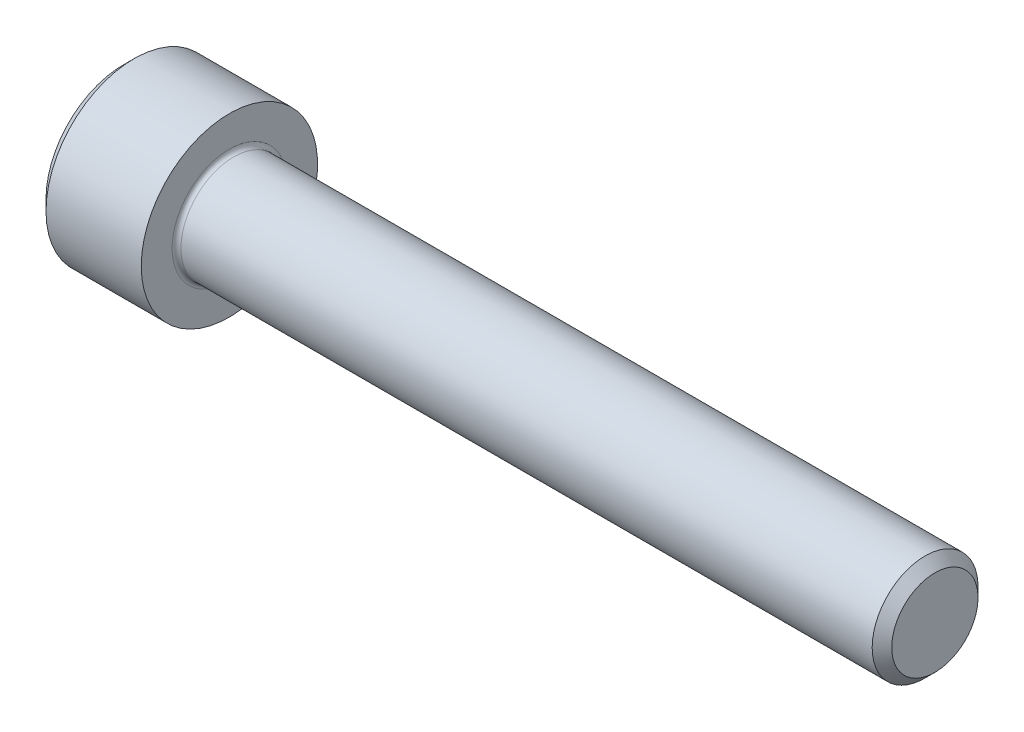
ISO-10303-21;
HEADER;
FILE_DESCRIPTION(('STEP AP214'),'2;1');
FILE_NAME('part.step','',(''),(''),'','','');
FILE_SCHEMA(('AUTOMOTIVE_DESIGN { 1 0 10303 214 1 1 1 1 }'));
ENDSEC;
DATA;
#1=APPLICATION_CONTEXT('core data for automotive mechanical design processes');
#2=APPLICATION_PROTOCOL_DEFINITION('international standard','automotive_design',2000,#1);
#3=PRODUCT_CONTEXT('',#1,'mechanical');
#4=PRODUCT('Part','Part','',(#3));
#5=PRODUCT_RELATED_PRODUCT_CATEGORY('part','',(#4));
#6=PRODUCT_DEFINITION_FORMATION('','',#4);
#7=PRODUCT_DEFINITION_CONTEXT('part definition',#1,'design');
#8=PRODUCT_DEFINITION('design','',#6,#7);
#9=PRODUCT_DEFINITION_SHAPE('','',#8);
#10=(LENGTH_UNIT() NAMED_UNIT(*) SI_UNIT(.MILLI.,.METRE.));
#11=(NAMED_UNIT(*) PLANE_ANGLE_UNIT() SI_UNIT($,.RADIAN.));
#12=(NAMED_UNIT(*) SI_UNIT($,.STERADIAN.) SOLID_ANGLE_UNIT());
#13=UNCERTAINTY_MEASURE_WITH_UNIT(LENGTH_MEASURE(1.E-05),#10,'distance_accuracy_value','');
#14=(GEOMETRIC_REPRESENTATION_CONTEXT(3) GLOBAL_UNCERTAINTY_ASSIGNED_CONTEXT((#13)) GLOBAL_UNIT_ASSIGNED_CONTEXT((#10,
#11,#12)) REPRESENTATION_CONTEXT('',''));
#15=CARTESIAN_POINT('',(0.,0.,0.));
#16=DIRECTION('',(0.,0.,1.));
#17=DIRECTION('',(1.,0.,0.));
#18=AXIS2_PLACEMENT_3D('',#15,#16,#17);
#19=CARTESIAN_POINT('',(0.,0.,0.));
#20=DIRECTION('',(-1.,0.,0.));
#21=DIRECTION('',(0.,0.,1.));
#22=AXIS2_PLACEMENT_3D('',#19,#20,#21);
#23=PLANE('',#22);
#24=DIRECTION('',(0.,-0.5,0.866025403784438));
#25=VECTOR('',#24,1.);
#26=CARTESIAN_POINT('',(0.,2.93524876856006,0.));
#27=LINE('',#26,#25);
#28=CARTESIAN_POINT('',(0.,2.93524876856006,0.));
#29=VERTEX_POINT('',#28);
#30=CARTESIAN_POINT('',(0.,1.46762438428003,2.542));
#31=VERTEX_POINT('',#30);
#32=EDGE_CURVE('E387',#29,#31,#27,.T.);
#33=ORIENTED_EDGE('',*,*,#32,.T.);
#34=DIRECTION('',(0.,1.,0.));
#35=VECTOR('',#34,1.);
#36=CARTESIAN_POINT('',(0.,-1.46762438428003,2.542));
#37=LINE('',#36,#35);
#38=CARTESIAN_POINT('',(0.,-1.46762438428003,2.542));
#39=VERTEX_POINT('',#38);
#40=EDGE_CURVE('E131',#39,#31,#37,.T.);
#41=ORIENTED_EDGE('',*,*,#40,.F.);
#42=DIRECTION('',(0.,-0.500000000000001,-0.866025403784438));
#43=VECTOR('',#42,1.);
#44=CARTESIAN_POINT('',(0.,-1.46762438428003,2.542));
#45=LINE('',#44,#43);
#46=CARTESIAN_POINT('',(0.,-2.93524876856006,0.));
#47=VERTEX_POINT('',#46);
#48=EDGE_CURVE('E390',#39,#47,#45,.T.);
#49=ORIENTED_EDGE('',*,*,#48,.T.);
#50=DIRECTION('',(0.,0.5,-0.866025403784439));
#51=VECTOR('',#50,1.);
#52=CARTESIAN_POINT('',(0.,-2.93524876856006,0.));
#53=LINE('',#52,#51);
#54=CARTESIAN_POINT('',(0.,-1.46762438428003,-2.542));
#55=VERTEX_POINT('',#54);
#56=EDGE_CURVE('E393',#47,#55,#53,.T.);
#57=ORIENTED_EDGE('',*,*,#56,.T.);
#58=DIRECTION('',(0.,-1.,0.));
#59=VECTOR('',#58,1.);
#60=CARTESIAN_POINT('',(0.,1.46762438428002,-2.542));
#61=LINE('',#60,#59);
#62=CARTESIAN_POINT('',(0.,1.46762438428002,-2.542));
#63=VERTEX_POINT('',#62);
#64=EDGE_CURVE('E396',#63,#55,#61,.T.);
#65=ORIENTED_EDGE('',*,*,#64,.F.);
#66=DIRECTION('',(0.,-0.500000000000001,-0.866025403784438));
#67=VECTOR('',#66,1.);
#68=CARTESIAN_POINT('',(0.,2.93524876856006,0.));
#69=LINE('',#68,#67);
#70=EDGE_CURVE('E126',#29,#63,#69,.T.);
#71=ORIENTED_EDGE('',*,*,#70,.F.);
#72=EDGE_LOOP('',(#33,#41,#49,#57,#65,#71));
#73=FACE_BOUND('',#72,.T.);
#74=CARTESIAN_POINT('',(0.,0.,0.));
#75=DIRECTION('',(-1.,0.,0.));
#76=DIRECTION('',(0.,0.,1.));
#77=AXIS2_PLACEMENT_3D('',#74,#75,#76);
#78=CIRCLE('',#77,4.4);
#79=CARTESIAN_POINT('',(0.,0.,4.4));
#80=VERTEX_POINT('',#79);
#81=EDGE_CURVE('E142',#80,#80,#78,.T.);
#82=ORIENTED_EDGE('',*,*,#81,.T.);
#83=EDGE_LOOP('',(#82));
#84=FACE_BOUND('',#83,.T.);
#85=ADVANCED_FACE('F35',(#73,#84),#23,.T.);
#86=CARTESIAN_POINT('',(46.,2.4455,0.));
#87=DIRECTION('',(1.,0.,0.));
#88=DIRECTION('',(0.,0.,-1.));
#89=AXIS2_PLACEMENT_3D('',#86,#87,#88);
#90=PLANE('',#89);
#91=CARTESIAN_POINT('',(46.,0.,0.));
#92=DIRECTION('',(-1.,0.,0.));
#93=DIRECTION('',(0.,0.,1.));
#94=AXIS2_PLACEMENT_3D('',#91,#92,#93);
#95=CIRCLE('',#94,2.4455);
#96=CARTESIAN_POINT('',(46.,0.,2.4455));
#97=VERTEX_POINT('',#96);
#98=EDGE_CURVE('E155',#97,#97,#95,.T.);
#99=ORIENTED_EDGE('',*,*,#98,.F.);
#100=EDGE_LOOP('',(#99));
#101=FACE_BOUND('',#100,.T.);
#102=ADVANCED_FACE('F176',(#101),#90,.T.);
#103=CARTESIAN_POINT('',(46.,0.,0.));
#104=DIRECTION('',(-1.,0.,0.));
#105=DIRECTION('',(0.,0.,1.));
#106=AXIS2_PLACEMENT_3D('',#103,#104,#105);
#107=CONICAL_SURFACE('',#106,2.4455,0.785398163397216);
#108=CARTESIAN_POINT('',(45.4454999999999,0.,0.));
#109=DIRECTION('',(-1.,0.,0.));
#110=DIRECTION('',(0.,0.,1.));
#111=AXIS2_PLACEMENT_3D('',#108,#109,#110);
#112=CIRCLE('',#111,2.99999999999987);
#113=CARTESIAN_POINT('',(45.4454999999999,0.,2.99999999999987));
#114=VERTEX_POINT('',#113);
#115=EDGE_CURVE('E152',#114,#114,#112,.T.);
#116=ORIENTED_EDGE('',*,*,#115,.F.);
#117=EDGE_LOOP('',(#116));
#118=FACE_BOUND('',#117,.T.);
#119=ORIENTED_EDGE('',*,*,#98,.T.);
#120=EDGE_LOOP('',(#119));
#121=FACE_BOUND('',#120,.T.);
#122=ADVANCED_FACE('F182',(#118,#121),#107,.T.);
#123=CARTESIAN_POINT('',(-31.75,0.,0.));
#124=DIRECTION('',(-1.,0.,0.));
#125=DIRECTION('',(0.,0.,1.));
#126=AXIS2_PLACEMENT_3D('',#123,#124,#125);
#127=CYLINDRICAL_SURFACE('',#126,2.99999999999993);
#128=CARTESIAN_POINT('',(6.25,0.,0.));
#129=DIRECTION('',(1.,0.,0.));
#130=DIRECTION('',(0.,0.,-1.));
#131=AXIS2_PLACEMENT_3D('',#128,#129,#130);
#132=CIRCLE('',#131,2.99999999999993);
#133=CARTESIAN_POINT('',(6.25,0.,-2.99999999999993));
#134=VERTEX_POINT('',#133);
#135=EDGE_CURVE('E11',#134,#134,#132,.T.);
#136=ORIENTED_EDGE('',*,*,#135,.T.);
#137=EDGE_LOOP('',(#136));
#138=FACE_BOUND('',#137,.T.);
#139=ORIENTED_EDGE('',*,*,#115,.T.);
#140=EDGE_LOOP('',(#139));
#141=FACE_BOUND('',#140,.T.);
#142=ADVANCED_FACE('F193',(#138,#141),#127,.T.);
#143=CARTESIAN_POINT('',(6.,5.,0.));
#144=DIRECTION('',(1.,0.,0.));
#145=DIRECTION('',(0.,0.,-1.));
#146=AXIS2_PLACEMENT_3D('',#143,#144,#145);
#147=PLANE('',#146);
#148=CARTESIAN_POINT('',(6.,0.,0.));
#149=DIRECTION('',(1.,0.,0.));
#150=DIRECTION('',(0.,0.,-1.));
#151=AXIS2_PLACEMENT_3D('',#148,#149,#150);
#152=CIRCLE('',#151,3.24999999999993);
#153=CARTESIAN_POINT('',(6.,0.,-3.24999999999993));
#154=VERTEX_POINT('',#153);
#155=EDGE_CURVE('E43',#154,#154,#152,.F.);
#156=ORIENTED_EDGE('',*,*,#155,.T.);
#157=EDGE_LOOP('',(#156));
#158=FACE_BOUND('',#157,.T.);
#159=CARTESIAN_POINT('',(6.,0.,0.));
#160=DIRECTION('',(-1.,0.,0.));
#161=DIRECTION('',(0.,0.,1.));
#162=AXIS2_PLACEMENT_3D('',#159,#160,#161);
#163=CIRCLE('',#162,5.);
#164=CARTESIAN_POINT('',(6.,0.,5.));
#165=VERTEX_POINT('',#164);
#166=EDGE_CURVE('E149',#165,#165,#163,.T.);
#167=ORIENTED_EDGE('',*,*,#166,.F.);
#168=EDGE_LOOP('',(#167));
#169=FACE_BOUND('',#168,.T.);
#170=ADVANCED_FACE('F160',(#158,#169),#147,.T.);
#171=CARTESIAN_POINT('',(-31.75,0.,0.));
#172=DIRECTION('',(-1.,0.,0.));
#173=DIRECTION('',(0.,0.,1.));
#174=AXIS2_PLACEMENT_3D('',#171,#172,#173);
#175=CYLINDRICAL_SURFACE('',#174,5.);
#176=ORIENTED_EDGE('',*,*,#166,.T.);
#177=EDGE_LOOP('',(#176));
#178=FACE_BOUND('',#177,.T.);
#179=CARTESIAN_POINT('',(0.600000000000003,0.,0.));
#180=DIRECTION('',(-1.,0.,0.));
#181=DIRECTION('',(0.,0.,1.));
#182=AXIS2_PLACEMENT_3D('',#179,#180,#181);
#183=CIRCLE('',#182,5.);
#184=CARTESIAN_POINT('',(0.600000000000003,0.,5.));
#185=VERTEX_POINT('',#184);
#186=EDGE_CURVE('E146',#185,#185,#183,.T.);
#187=ORIENTED_EDGE('',*,*,#186,.F.);
#188=EDGE_LOOP('',(#187));
#189=FACE_BOUND('',#188,.T.);
#190=ADVANCED_FACE('F171',(#178,#189),#175,.T.);
#191=CARTESIAN_POINT('',(0.,0.,0.));
#192=DIRECTION('',(1.,0.,0.));
#193=DIRECTION('',(0.,0.,-1.));
#194=AXIS2_PLACEMENT_3D('',#191,#192,#193);
#195=CONICAL_SURFACE('',#194,4.4,0.785398163397448);
#196=ORIENTED_EDGE('',*,*,#186,.T.);
#197=EDGE_LOOP('',(#196));
#198=FACE_BOUND('',#197,.T.);
#199=ORIENTED_EDGE('',*,*,#81,.F.);
#200=EDGE_LOOP('',(#199));
#201=FACE_BOUND('',#200,.T.);
#202=ADVANCED_FACE('F164',(#198,#201),#195,.T.);
#203=CARTESIAN_POINT('',(6.25,0.,0.));
#204=DIRECTION('',(1.,0.,0.));
#205=DIRECTION('',(0.,0.,-1.));
#206=AXIS2_PLACEMENT_3D('',#203,#204,#205);
#207=TOROIDAL_SURFACE('',#206,3.24999999999993,0.25);
#208=ORIENTED_EDGE('',*,*,#135,.F.);
#209=EDGE_LOOP('',(#208));
#210=FACE_BOUND('',#209,.T.);
#211=ORIENTED_EDGE('',*,*,#155,.F.);
#212=EDGE_LOOP('',(#211));
#213=FACE_BOUND('',#212,.T.);
#214=ADVANCED_FACE('F37',(#210,#213),#207,.F.);
#215=CARTESIAN_POINT('',(3.,2.93524876856006,0.));
#216=DIRECTION('',(0.,-0.866025403784439,-0.5));
#217=DIRECTION('',(0.,0.5,-0.866025403784439));
#218=AXIS2_PLACEMENT_3D('',#215,#216,#217);
#219=PLANE('',#218);
#220=ORIENTED_EDGE('',*,*,#32,.F.);
#221=DIRECTION('',(-1.,0.,0.));
#222=VECTOR('',#221,1.);
#223=CARTESIAN_POINT('',(3.,2.93524876856006,0.));
#224=LINE('',#223,#222);
#225=CARTESIAN_POINT('',(3.,2.93524876856006,0.));
#226=VERTEX_POINT('',#225);
#227=EDGE_CURVE('E377',#226,#29,#224,.T.);
#228=ORIENTED_EDGE('',*,*,#227,.F.);
#229=DIRECTION('',(0.,-0.5,0.866025403784438));
#230=VECTOR('',#229,1.);
#231=CARTESIAN_POINT('',(3.,2.93524876856006,0.));
#232=LINE('',#231,#230);
#233=CARTESIAN_POINT('',(3.,2.20143657642004,1.271));
#234=VERTEX_POINT('',#233);
#235=EDGE_CURVE('E118',#226,#234,#232,.T.);
#236=ORIENTED_EDGE('',*,*,#235,.T.);
#237=CARTESIAN_POINT('',(3.,1.46762438428003,2.542));
#238=VERTEX_POINT('',#237);
#239=EDGE_CURVE('E109',#234,#238,#232,.T.);
#240=ORIENTED_EDGE('',*,*,#239,.T.);
#241=DIRECTION('',(-1.,0.,0.));
#242=VECTOR('',#241,1.);
#243=CARTESIAN_POINT('',(3.,1.46762438428003,2.542));
#244=LINE('',#243,#242);
#245=EDGE_CURVE('E123',#238,#31,#244,.T.);
#246=ORIENTED_EDGE('',*,*,#245,.T.);
#247=EDGE_LOOP('',(#220,#228,#236,#240,#246));
#248=FACE_BOUND('',#247,.T.);
#249=ADVANCED_FACE('F122',(#248),#219,.T.);
#250=CARTESIAN_POINT('',(3.,-1.46762438428003,2.542));
#251=DIRECTION('',(0.,0.,1.));
#252=DIRECTION('',(0.,-1.,0.));
#253=AXIS2_PLACEMENT_3D('',#250,#251,#252);
#254=PLANE('',#253);
#255=ORIENTED_EDGE('',*,*,#40,.T.);
#256=ORIENTED_EDGE('',*,*,#245,.F.);
#257=DIRECTION('',(0.,1.,0.));
#258=VECTOR('',#257,1.);
#259=CARTESIAN_POINT('',(3.,-1.46762438428003,2.542));
#260=LINE('',#259,#258);
#261=CARTESIAN_POINT('',(3.,0.,2.542));
#262=VERTEX_POINT('',#261);
#263=EDGE_CURVE('E106',#262,#238,#260,.T.);
#264=ORIENTED_EDGE('',*,*,#263,.F.);
#265=CARTESIAN_POINT('',(3.,-1.46762438428003,2.542));
#266=VERTEX_POINT('',#265);
#267=EDGE_CURVE('E117',#266,#262,#260,.T.);
#268=ORIENTED_EDGE('',*,*,#267,.F.);
#269=DIRECTION('',(-1.,0.,0.));
#270=VECTOR('',#269,1.);
#271=CARTESIAN_POINT('',(3.,-1.46762438428003,2.542));
#272=LINE('',#271,#270);
#273=EDGE_CURVE('E133',#266,#39,#272,.T.);
#274=ORIENTED_EDGE('',*,*,#273,.T.);
#275=EDGE_LOOP('',(#255,#256,#264,#268,#274));
#276=FACE_BOUND('',#275,.T.);
#277=ADVANCED_FACE('F128',(#276),#254,.F.);
#278=CARTESIAN_POINT('',(3.,-1.46762438428003,2.542));
#279=DIRECTION('',(0.,0.866025403784438,-0.500000000000001));
#280=DIRECTION('',(0.,0.500000000000001,0.866025403784438));
#281=AXIS2_PLACEMENT_3D('',#278,#279,#280);
#282=PLANE('',#281);
#283=ORIENTED_EDGE('',*,*,#48,.F.);
#284=ORIENTED_EDGE('',*,*,#273,.F.);
#285=DIRECTION('',(0.,-0.500000000000001,-0.866025403784438));
#286=VECTOR('',#285,1.);
#287=CARTESIAN_POINT('',(3.,-1.46762438428003,2.542));
#288=LINE('',#287,#286);
#289=CARTESIAN_POINT('',(3.,-2.20143657642004,1.271));
#290=VERTEX_POINT('',#289);
#291=EDGE_CURVE('E416',#266,#290,#288,.T.);
#292=ORIENTED_EDGE('',*,*,#291,.T.);
#293=CARTESIAN_POINT('',(3.,-2.93524876856006,0.));
#294=VERTEX_POINT('',#293);
#295=EDGE_CURVE('E405',#290,#294,#288,.T.);
#296=ORIENTED_EDGE('',*,*,#295,.T.);
#297=DIRECTION('',(-1.,0.,0.));
#298=VECTOR('',#297,1.);
#299=CARTESIAN_POINT('',(3.,-2.93524876856006,0.));
#300=LINE('',#299,#298);
#301=EDGE_CURVE('E138',#294,#47,#300,.T.);
#302=ORIENTED_EDGE('',*,*,#301,.T.);
#303=EDGE_LOOP('',(#283,#284,#292,#296,#302));
#304=FACE_BOUND('',#303,.T.);
#305=ADVANCED_FACE('F268',(#304),#282,.T.);
#306=CARTESIAN_POINT('',(3.,-2.93524876856006,0.));
#307=DIRECTION('',(0.,0.866025403784439,0.5));
#308=DIRECTION('',(0.,-0.5,0.866025403784439));
#309=AXIS2_PLACEMENT_3D('',#306,#307,#308);
#310=PLANE('',#309);
#311=ORIENTED_EDGE('',*,*,#56,.F.);
#312=ORIENTED_EDGE('',*,*,#301,.F.);
#313=DIRECTION('',(0.,0.5,-0.866025403784439));
#314=VECTOR('',#313,1.);
#315=CARTESIAN_POINT('',(3.,-2.93524876856006,0.));
#316=LINE('',#315,#314);
#317=CARTESIAN_POINT('',(3.,-2.20143657642005,-1.271));
#318=VERTEX_POINT('',#317);
#319=EDGE_CURVE('E383',#294,#318,#316,.T.);
#320=ORIENTED_EDGE('',*,*,#319,.T.);
#321=CARTESIAN_POINT('',(3.,-1.46762438428003,-2.542));
#322=VERTEX_POINT('',#321);
#323=EDGE_CURVE('E415',#318,#322,#316,.T.);
#324=ORIENTED_EDGE('',*,*,#323,.T.);
#325=DIRECTION('',(-1.,0.,0.));
#326=VECTOR('',#325,1.);
#327=CARTESIAN_POINT('',(3.,-1.46762438428003,-2.542));
#328=LINE('',#327,#326);
#329=EDGE_CURVE('E376',#322,#55,#328,.T.);
#330=ORIENTED_EDGE('',*,*,#329,.T.);
#331=EDGE_LOOP('',(#311,#312,#320,#324,#330));
#332=FACE_BOUND('',#331,.T.);
#333=ADVANCED_FACE('F276',(#332),#310,.T.);
#334=CARTESIAN_POINT('',(3.,1.46762438428002,-2.542));
#335=DIRECTION('',(0.,0.,-1.));
#336=DIRECTION('',(0.,1.,0.));
#337=AXIS2_PLACEMENT_3D('',#334,#335,#336);
#338=PLANE('',#337);
#339=ORIENTED_EDGE('',*,*,#64,.T.);
#340=ORIENTED_EDGE('',*,*,#329,.F.);
#341=DIRECTION('',(0.,-1.,0.));
#342=VECTOR('',#341,1.);
#343=CARTESIAN_POINT('',(3.,1.46762438428002,-2.542));
#344=LINE('',#343,#342);
#345=CARTESIAN_POINT('',(3.,0.,-2.542));
#346=VERTEX_POINT('',#345);
#347=EDGE_CURVE('E380',#346,#322,#344,.T.);
#348=ORIENTED_EDGE('',*,*,#347,.F.);
#349=CARTESIAN_POINT('',(3.,1.46762438428002,-2.542));
#350=VERTEX_POINT('',#349);
#351=EDGE_CURVE('E50',#350,#346,#344,.T.);
#352=ORIENTED_EDGE('',*,*,#351,.F.);
#353=DIRECTION('',(-1.,0.,0.));
#354=VECTOR('',#353,1.);
#355=CARTESIAN_POINT('',(3.,1.46762438428002,-2.542));
#356=LINE('',#355,#354);
#357=EDGE_CURVE('E373',#350,#63,#356,.T.);
#358=ORIENTED_EDGE('',*,*,#357,.T.);
#359=EDGE_LOOP('',(#339,#340,#348,#352,#358));
#360=FACE_BOUND('',#359,.T.);
#361=ADVANCED_FACE('F285',(#360),#338,.F.);
#362=CARTESIAN_POINT('',(3.,2.93524876856006,0.));
#363=DIRECTION('',(0.,0.866025403784438,-0.500000000000001));
#364=DIRECTION('',(0.,0.500000000000001,0.866025403784438));
#365=AXIS2_PLACEMENT_3D('',#362,#363,#364);
#366=PLANE('',#365);
#367=ORIENTED_EDGE('',*,*,#70,.T.);
#368=ORIENTED_EDGE('',*,*,#357,.F.);
#369=DIRECTION('',(0.,-0.500000000000001,-0.866025403784438));
#370=VECTOR('',#369,1.);
#371=CARTESIAN_POINT('',(3.,2.93524876856006,0.));
#372=LINE('',#371,#370);
#373=CARTESIAN_POINT('',(3.,2.20143657642004,-1.271));
#374=VERTEX_POINT('',#373);
#375=EDGE_CURVE('E363',#374,#350,#372,.T.);
#376=ORIENTED_EDGE('',*,*,#375,.F.);
#377=EDGE_CURVE('E369',#226,#374,#372,.T.);
#378=ORIENTED_EDGE('',*,*,#377,.F.);
#379=ORIENTED_EDGE('',*,*,#227,.T.);
#380=EDGE_LOOP('',(#367,#368,#376,#378,#379));
#381=FACE_BOUND('',#380,.T.);
#382=ADVANCED_FACE('F294',(#381),#366,.F.);
#383=CARTESIAN_POINT('',(3.,2.93524876856006,0.));
#384=DIRECTION('',(1.,0.,0.));
#385=DIRECTION('',(0.,0.,-1.));
#386=AXIS2_PLACEMENT_3D('',#383,#384,#385);
#387=PLANE('',#386);
#388=ORIENTED_EDGE('',*,*,#347,.T.);
#389=ORIENTED_EDGE('',*,*,#323,.F.);
#390=CARTESIAN_POINT('',(3.,0.,0.));
#391=DIRECTION('',(-1.,0.,0.));
#392=DIRECTION('',(0.,0.,1.));
#393=AXIS2_PLACEMENT_3D('',#390,#391,#392);
#394=CIRCLE('',#393,2.542);
#395=EDGE_CURVE('E411',#346,#318,#394,.T.);
#396=ORIENTED_EDGE('',*,*,#395,.F.);
#397=EDGE_LOOP('',(#388,#389,#396));
#398=FACE_BOUND('',#397,.T.);
#399=ADVANCED_FACE('F303',(#398),#387,.F.);
#400=ORIENTED_EDGE('',*,*,#319,.F.);
#401=ORIENTED_EDGE('',*,*,#295,.F.);
#402=EDGE_CURVE('E136',#318,#290,#394,.T.);
#403=ORIENTED_EDGE('',*,*,#402,.F.);
#404=EDGE_LOOP('',(#400,#401,#403));
#405=FACE_BOUND('',#404,.T.);
#406=ADVANCED_FACE('F312',(#405),#387,.F.);
#407=ORIENTED_EDGE('',*,*,#291,.F.);
#408=ORIENTED_EDGE('',*,*,#267,.T.);
#409=EDGE_CURVE('E132',#290,#262,#394,.T.);
#410=ORIENTED_EDGE('',*,*,#409,.F.);
#411=EDGE_LOOP('',(#407,#408,#410));
#412=FACE_BOUND('',#411,.T.);
#413=ADVANCED_FACE('F321',(#412),#387,.F.);
#414=ORIENTED_EDGE('',*,*,#263,.T.);
#415=ORIENTED_EDGE('',*,*,#239,.F.);
#416=EDGE_CURVE('E112',#262,#234,#394,.T.);
#417=ORIENTED_EDGE('',*,*,#416,.F.);
#418=EDGE_LOOP('',(#414,#415,#417));
#419=FACE_BOUND('',#418,.T.);
#420=ADVANCED_FACE('F108',(#419),#387,.F.);
#421=ORIENTED_EDGE('',*,*,#235,.F.);
#422=ORIENTED_EDGE('',*,*,#377,.T.);
#423=EDGE_CURVE('E143',#234,#374,#394,.T.);
#424=ORIENTED_EDGE('',*,*,#423,.F.);
#425=EDGE_LOOP('',(#421,#422,#424));
#426=FACE_BOUND('',#425,.T.);
#427=ADVANCED_FACE('F336',(#426),#387,.F.);
#428=ORIENTED_EDGE('',*,*,#375,.T.);
#429=ORIENTED_EDGE('',*,*,#351,.T.);
#430=EDGE_CURVE('E366',#374,#346,#394,.T.);
#431=ORIENTED_EDGE('',*,*,#430,.F.);
#432=EDGE_LOOP('',(#428,#429,#431));
#433=FACE_BOUND('',#432,.T.);
#434=ADVANCED_FACE('F251',(#433),#387,.F.);
#435=CARTESIAN_POINT('',(3.,0.,0.));
#436=DIRECTION('',(-1.,0.,0.));
#437=DIRECTION('',(0.,0.,1.));
#438=AXIS2_PLACEMENT_3D('',#435,#436,#437);
#439=CONICAL_SURFACE('',#438,2.542,1.04719755119659);
#440=CARTESIAN_POINT('',(4.46762438428004,0.,0.));
#441=VERTEX_POINT('',#440);
#442=VERTEX_LOOP('',#441);
#443=FACE_BOUND('',#442,.T.);
#444=ORIENTED_EDGE('',*,*,#416,.T.);
#445=ORIENTED_EDGE('',*,*,#423,.T.);
#446=ORIENTED_EDGE('',*,*,#430,.T.);
#447=ORIENTED_EDGE('',*,*,#395,.T.);
#448=ORIENTED_EDGE('',*,*,#402,.T.);
#449=ORIENTED_EDGE('',*,*,#409,.T.);
#450=EDGE_LOOP('',(#444,#445,#446,#447,#448,#449));
#451=FACE_BOUND('',#450,.T.);
#452=ADVANCED_FACE('F186',(#443,#451),#439,.F.);
#453=CLOSED_SHELL('',(#85,#102,#122,#142,#170,#190,#202,#214,#249,#277,#305,#333,#361,#382,#399,
#406,#413,#420,#427,#434,#452));
#454=MANIFOLD_SOLID_BREP('B2',#453);
#455=ADVANCED_BREP_SHAPE_REPRESENTATION('',(#18,#454),#14);
#456=SHAPE_DEFINITION_REPRESENTATION(#9,#455);
ENDSEC;
END-ISO-10303-21;
